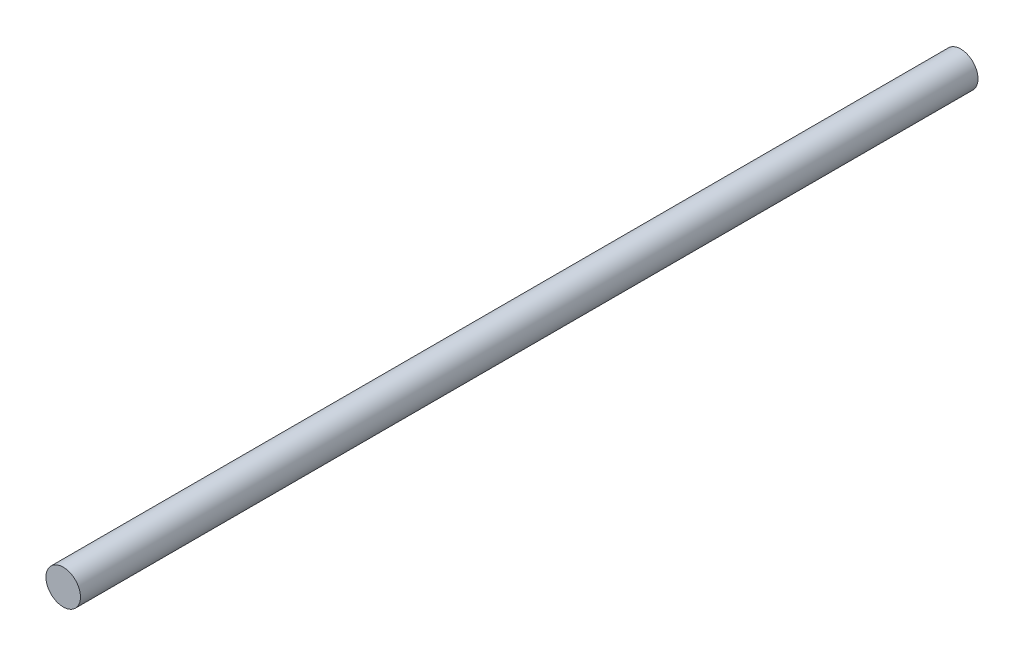
ISO-10303-21;
HEADER;
FILE_DESCRIPTION(('STEP AP214'),'2;1');
FILE_NAME('part.step','',(''),(''),'','','');
FILE_SCHEMA(('AUTOMOTIVE_DESIGN { 1 0 10303 214 1 1 1 1 }'));
ENDSEC;
DATA;
#1=APPLICATION_CONTEXT('core data for automotive mechanical design processes');
#2=APPLICATION_PROTOCOL_DEFINITION('international standard','automotive_design',2000,#1);
#3=PRODUCT_CONTEXT('',#1,'mechanical');
#4=PRODUCT('Part','Part','',(#3));
#5=PRODUCT_RELATED_PRODUCT_CATEGORY('part','',(#4));
#6=PRODUCT_DEFINITION_FORMATION('','',#4);
#7=PRODUCT_DEFINITION_CONTEXT('part definition',#1,'design');
#8=PRODUCT_DEFINITION('design','',#6,#7);
#9=PRODUCT_DEFINITION_SHAPE('','',#8);
#10=(LENGTH_UNIT() NAMED_UNIT(*) SI_UNIT(.MILLI.,.METRE.));
#11=(NAMED_UNIT(*) PLANE_ANGLE_UNIT() SI_UNIT($,.RADIAN.));
#12=(NAMED_UNIT(*) SI_UNIT($,.STERADIAN.) SOLID_ANGLE_UNIT());
#13=UNCERTAINTY_MEASURE_WITH_UNIT(LENGTH_MEASURE(1.E-05),#10,'distance_accuracy_value','');
#14=(GEOMETRIC_REPRESENTATION_CONTEXT(3) GLOBAL_UNCERTAINTY_ASSIGNED_CONTEXT((#13)) GLOBAL_UNIT_ASSIGNED_CONTEXT((#10,
#11,#12)) REPRESENTATION_CONTEXT('',''));
#15=CARTESIAN_POINT('',(0.,0.,0.));
#16=DIRECTION('',(0.,0.,1.));
#17=DIRECTION('',(1.,0.,0.));
#18=AXIS2_PLACEMENT_3D('',#15,#16,#17);
#19=CARTESIAN_POINT('',(-19.0148030021392,7.497720805539,260.));
#20=DIRECTION('',(0.,0.,-1.));
#21=DIRECTION('',(-1.,0.,0.));
#22=AXIS2_PLACEMENT_3D('',#19,#20,#21);
#23=CYLINDRICAL_SURFACE('',#22,5.);
#24=CARTESIAN_POINT('',(-19.0148030021392,7.497720805539,260.));
#25=DIRECTION('',(0.,0.,1.));
#26=DIRECTION('',(1.,0.,0.));
#27=AXIS2_PLACEMENT_3D('',#24,#25,#26);
#28=CIRCLE('',#27,5.);
#29=CARTESIAN_POINT('',(-14.0148030021392,7.497720805539,260.));
#30=VERTEX_POINT('',#29);
#31=EDGE_CURVE('E10',#30,#30,#28,.T.);
#32=ORIENTED_EDGE('',*,*,#31,.F.);
#33=EDGE_LOOP('',(#32));
#34=FACE_BOUND('',#33,.T.);
#35=CARTESIAN_POINT('',(-19.0148030021392,7.497720805539,0.));
#36=DIRECTION('',(0.,0.,1.));
#37=DIRECTION('',(1.,0.,0.));
#38=AXIS2_PLACEMENT_3D('',#35,#36,#37);
#39=CIRCLE('',#38,5.);
#40=CARTESIAN_POINT('',(-14.0148030021392,7.497720805539,0.));
#41=VERTEX_POINT('',#40);
#42=EDGE_CURVE('E34',#41,#41,#39,.T.);
#43=ORIENTED_EDGE('',*,*,#42,.T.);
#44=EDGE_LOOP('',(#43));
#45=FACE_BOUND('',#44,.T.);
#46=ADVANCED_FACE('F31',(#34,#45),#23,.T.);
#47=CARTESIAN_POINT('',(-19.0148030021392,7.497720805539,260.));
#48=DIRECTION('',(0.,0.,1.));
#49=DIRECTION('',(1.,0.,0.));
#50=AXIS2_PLACEMENT_3D('',#47,#48,#49);
#51=PLANE('',#50);
#52=ORIENTED_EDGE('',*,*,#31,.T.);
#53=EDGE_LOOP('',(#52));
#54=FACE_BOUND('',#53,.T.);
#55=ADVANCED_FACE('F46',(#54),#51,.T.);
#56=CARTESIAN_POINT('',(-19.0148030021392,7.497720805539,0.));
#57=DIRECTION('',(0.,0.,1.));
#58=DIRECTION('',(1.,0.,0.));
#59=AXIS2_PLACEMENT_3D('',#56,#57,#58);
#60=PLANE('',#59);
#61=ORIENTED_EDGE('',*,*,#42,.F.);
#62=EDGE_LOOP('',(#61));
#63=FACE_BOUND('',#62,.T.);
#64=ADVANCED_FACE('F44',(#63),#60,.F.);
#65=CLOSED_SHELL('',(#46,#55,#64));
#66=MANIFOLD_SOLID_BREP('B2',#65);
#67=ADVANCED_BREP_SHAPE_REPRESENTATION('',(#18,#66),#14);
#68=SHAPE_DEFINITION_REPRESENTATION(#9,#67);
ENDSEC;
END-ISO-10303-21;
